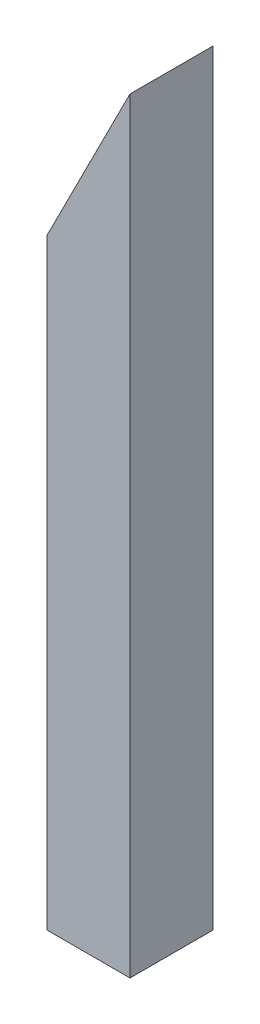
ISO-10303-21;
HEADER;
FILE_DESCRIPTION(('STEP AP214'),'2;1');
FILE_NAME('part.step','',(''),(''),'','','');
FILE_SCHEMA(('AUTOMOTIVE_DESIGN { 1 0 10303 214 1 1 1 1 }'));
ENDSEC;
DATA;
#1=APPLICATION_CONTEXT('core data for automotive mechanical design processes');
#2=APPLICATION_PROTOCOL_DEFINITION('international standard','automotive_design',2000,#1);
#3=PRODUCT_CONTEXT('',#1,'mechanical');
#4=PRODUCT('Part','Part','',(#3));
#5=PRODUCT_RELATED_PRODUCT_CATEGORY('part','',(#4));
#6=PRODUCT_DEFINITION_FORMATION('','',#4);
#7=PRODUCT_DEFINITION_CONTEXT('part definition',#1,'design');
#8=PRODUCT_DEFINITION('design','',#6,#7);
#9=PRODUCT_DEFINITION_SHAPE('','',#8);
#10=(LENGTH_UNIT() NAMED_UNIT(*) SI_UNIT(.MILLI.,.METRE.));
#11=(NAMED_UNIT(*) PLANE_ANGLE_UNIT() SI_UNIT($,.RADIAN.));
#12=(NAMED_UNIT(*) SI_UNIT($,.STERADIAN.) SOLID_ANGLE_UNIT());
#13=UNCERTAINTY_MEASURE_WITH_UNIT(LENGTH_MEASURE(1.E-05),#10,'distance_accuracy_value','');
#14=(GEOMETRIC_REPRESENTATION_CONTEXT(3) GLOBAL_UNCERTAINTY_ASSIGNED_CONTEXT((#13)) GLOBAL_UNIT_ASSIGNED_CONTEXT((#10,
#11,#12)) REPRESENTATION_CONTEXT('',''));
#15=CARTESIAN_POINT('',(0.,0.,0.));
#16=DIRECTION('',(0.,0.,1.));
#17=DIRECTION('',(1.,0.,0.));
#18=AXIS2_PLACEMENT_3D('',#15,#16,#17);
#19=CARTESIAN_POINT('',(0.,1472.10714489838,203.2));
#20=DIRECTION('',(1.,0.,0.));
#21=DIRECTION('',(0.,1.,0.));
#22=AXIS2_PLACEMENT_3D('',#19,#20,#21);
#23=PLANE('',#22);
#24=DIRECTION('',(0.,-1.,0.));
#25=VECTOR('',#24,1.);
#26=CARTESIAN_POINT('',(0.,1472.10714489838,0.));
#27=LINE('',#26,#25);
#28=CARTESIAN_POINT('',(0.,1472.10714489838,0.));
#29=VERTEX_POINT('',#28);
#30=CARTESIAN_POINT('',(0.,0.,0.));
#31=VERTEX_POINT('',#30);
#32=EDGE_CURVE('E121',#29,#31,#27,.T.);
#33=ORIENTED_EDGE('',*,*,#32,.T.);
#34=DIRECTION('',(0.,0.,-1.));
#35=VECTOR('',#34,1.);
#36=CARTESIAN_POINT('',(0.,0.,203.2));
#37=LINE('',#36,#35);
#38=CARTESIAN_POINT('',(0.,0.,203.2));
#39=VERTEX_POINT('',#38);
#40=EDGE_CURVE('E148',#39,#31,#37,.T.);
#41=ORIENTED_EDGE('',*,*,#40,.F.);
#42=DIRECTION('',(0.,-1.,0.));
#43=VECTOR('',#42,1.);
#44=CARTESIAN_POINT('',(0.,1472.10714489838,203.2));
#45=LINE('',#44,#43);
#46=CARTESIAN_POINT('',(0.,1472.10714489838,203.2));
#47=VERTEX_POINT('',#46);
#48=EDGE_CURVE('E122',#47,#39,#45,.T.);
#49=ORIENTED_EDGE('',*,*,#48,.F.);
#50=DIRECTION('',(0.,0.,-1.));
#51=VECTOR('',#50,1.);
#52=CARTESIAN_POINT('',(0.,1472.10714489838,203.2));
#53=LINE('',#52,#51);
#54=EDGE_CURVE('E132',#47,#29,#53,.T.);
#55=ORIENTED_EDGE('',*,*,#54,.T.);
#56=EDGE_LOOP('',(#33,#41,#49,#55));
#57=FACE_BOUND('',#56,.T.);
#58=ADVANCED_FACE('F33',(#57),#23,.F.);
#59=CARTESIAN_POINT('',(0.,0.,203.2));
#60=DIRECTION('',(0.,1.,0.));
#61=DIRECTION('',(0.,0.,1.));
#62=AXIS2_PLACEMENT_3D('',#59,#60,#61);
#63=PLANE('',#62);
#64=DIRECTION('',(1.,0.,0.));
#65=VECTOR('',#64,1.);
#66=CARTESIAN_POINT('',(0.,0.,184.15));
#67=LINE('',#66,#65);
#68=CARTESIAN_POINT('',(19.05,4.44089209850063E-13,184.15));
#69=VERTEX_POINT('',#68);
#70=CARTESIAN_POINT('',(184.15,0.,184.15));
#71=VERTEX_POINT('',#70);
#72=EDGE_CURVE('E94',#69,#71,#67,.T.);
#73=ORIENTED_EDGE('',*,*,#72,.T.);
#74=DIRECTION('',(0.,0.,-1.));
#75=VECTOR('',#74,1.);
#76=CARTESIAN_POINT('',(184.15,0.,203.2));
#77=LINE('',#76,#75);
#78=CARTESIAN_POINT('',(184.15,4.44089209850063E-13,19.05));
#79=VERTEX_POINT('',#78);
#80=EDGE_CURVE('E116',#71,#79,#77,.T.);
#81=ORIENTED_EDGE('',*,*,#80,.T.);
#82=DIRECTION('',(-1.,0.,0.));
#83=VECTOR('',#82,1.);
#84=CARTESIAN_POINT('',(0.,0.,19.05));
#85=LINE('',#84,#83);
#86=CARTESIAN_POINT('',(19.05,4.44089209850063E-13,19.05));
#87=VERTEX_POINT('',#86);
#88=EDGE_CURVE('E114',#79,#87,#85,.T.);
#89=ORIENTED_EDGE('',*,*,#88,.T.);
#90=DIRECTION('',(0.,0.,1.));
#91=VECTOR('',#90,1.);
#92=CARTESIAN_POINT('',(19.05,0.,203.2));
#93=LINE('',#92,#91);
#94=EDGE_CURVE('E99',#87,#69,#93,.T.);
#95=ORIENTED_EDGE('',*,*,#94,.T.);
#96=EDGE_LOOP('',(#73,#81,#89,#95));
#97=FACE_BOUND('',#96,.T.);
#98=DIRECTION('',(1.,0.,0.));
#99=VECTOR('',#98,1.);
#100=CARTESIAN_POINT('',(0.,0.,0.));
#101=LINE('',#100,#99);
#102=CARTESIAN_POINT('',(203.2,0.,0.));
#103=VERTEX_POINT('',#102);
#104=EDGE_CURVE('E135',#31,#103,#101,.T.);
#105=ORIENTED_EDGE('',*,*,#104,.T.);
#106=DIRECTION('',(0.,0.,-1.));
#107=VECTOR('',#106,1.);
#108=CARTESIAN_POINT('',(203.2,0.,203.2));
#109=LINE('',#108,#107);
#110=CARTESIAN_POINT('',(203.2,0.,203.2));
#111=VERTEX_POINT('',#110);
#112=EDGE_CURVE('E145',#111,#103,#109,.T.);
#113=ORIENTED_EDGE('',*,*,#112,.F.);
#114=DIRECTION('',(1.,0.,0.));
#115=VECTOR('',#114,1.);
#116=CARTESIAN_POINT('',(0.,0.,203.2));
#117=LINE('',#116,#115);
#118=EDGE_CURVE('E125',#39,#111,#117,.T.);
#119=ORIENTED_EDGE('',*,*,#118,.F.);
#120=ORIENTED_EDGE('',*,*,#40,.T.);
#121=EDGE_LOOP('',(#105,#113,#119,#120));
#122=FACE_BOUND('',#121,.T.);
#123=ADVANCED_FACE('F112',(#97,#122),#63,.F.);
#124=CARTESIAN_POINT('',(203.2,0.,203.2));
#125=DIRECTION('',(-1.,0.,0.));
#126=DIRECTION('',(0.,0.,1.));
#127=AXIS2_PLACEMENT_3D('',#124,#125,#126);
#128=PLANE('',#127);
#129=DIRECTION('',(0.,1.,0.));
#130=VECTOR('',#129,1.);
#131=CARTESIAN_POINT('',(203.2,0.,0.));
#132=LINE('',#131,#130);
#133=CARTESIAN_POINT('',(203.2,1873.504,0.));
#134=VERTEX_POINT('',#133);
#135=EDGE_CURVE('E137',#103,#134,#132,.T.);
#136=ORIENTED_EDGE('',*,*,#135,.T.);
#137=DIRECTION('',(0.,0.,-1.));
#138=VECTOR('',#137,1.);
#139=CARTESIAN_POINT('',(203.2,1873.504,203.2));
#140=LINE('',#139,#138);
#141=CARTESIAN_POINT('',(203.2,1873.504,203.2));
#142=VERTEX_POINT('',#141);
#143=EDGE_CURVE('E142',#142,#134,#140,.T.);
#144=ORIENTED_EDGE('',*,*,#143,.F.);
#145=DIRECTION('',(0.,1.,0.));
#146=VECTOR('',#145,1.);
#147=CARTESIAN_POINT('',(203.2,0.,203.2));
#148=LINE('',#147,#146);
#149=EDGE_CURVE('E128',#111,#142,#148,.T.);
#150=ORIENTED_EDGE('',*,*,#149,.F.);
#151=ORIENTED_EDGE('',*,*,#112,.T.);
#152=EDGE_LOOP('',(#136,#144,#150,#151));
#153=FACE_BOUND('',#152,.T.);
#154=ADVANCED_FACE('F183',(#153),#128,.F.);
#155=CARTESIAN_POINT('',(203.2,1873.504,203.2));
#156=DIRECTION('',(0.892192013750188,-0.45165629697856,0.));
#157=DIRECTION('',(0.45165629697856,0.892192013750188,0.));
#158=AXIS2_PLACEMENT_3D('',#155,#156,#157);
#159=PLANE('',#158);
#160=DIRECTION('',(0.45165629697856,0.892192013750188,0.));
#161=VECTOR('',#160,1.);
#162=CARTESIAN_POINT('',(203.2,1873.504,19.05));
#163=LINE('',#162,#161);
#164=CARTESIAN_POINT('',(19.05,1509.73810006416,19.05));
#165=VERTEX_POINT('',#164);
#166=CARTESIAN_POINT('',(184.15,1835.87304483422,19.05));
#167=VERTEX_POINT('',#166);
#168=EDGE_CURVE('E40',#165,#167,#163,.T.);
#169=ORIENTED_EDGE('',*,*,#168,.T.);
#170=DIRECTION('',(0.,0.,1.));
#171=VECTOR('',#170,1.);
#172=CARTESIAN_POINT('',(184.15,1835.87304483422,203.2));
#173=LINE('',#172,#171);
#174=CARTESIAN_POINT('',(184.15,1835.87304483422,184.15));
#175=VERTEX_POINT('',#174);
#176=EDGE_CURVE('E11',#167,#175,#173,.T.);
#177=ORIENTED_EDGE('',*,*,#176,.T.);
#178=DIRECTION('',(-0.45165629697856,-0.892192013750188,0.));
#179=VECTOR('',#178,1.);
#180=CARTESIAN_POINT('',(203.2,1873.504,184.15));
#181=LINE('',#180,#179);
#182=CARTESIAN_POINT('',(19.05,1509.73810006416,184.15));
#183=VERTEX_POINT('',#182);
#184=EDGE_CURVE('E151',#175,#183,#181,.T.);
#185=ORIENTED_EDGE('',*,*,#184,.T.);
#186=DIRECTION('',(0.,0.,-1.));
#187=VECTOR('',#186,1.);
#188=CARTESIAN_POINT('',(19.05,1509.73810006416,203.2));
#189=LINE('',#188,#187);
#190=EDGE_CURVE('E107',#183,#165,#189,.T.);
#191=ORIENTED_EDGE('',*,*,#190,.T.);
#192=EDGE_LOOP('',(#169,#177,#185,#191));
#193=FACE_BOUND('',#192,.T.);
#194=DIRECTION('',(-0.45165629697856,-0.892192013750188,0.));
#195=VECTOR('',#194,1.);
#196=CARTESIAN_POINT('',(203.2,1873.504,0.));
#197=LINE('',#196,#195);
#198=EDGE_CURVE('E126',#134,#29,#197,.T.);
#199=ORIENTED_EDGE('',*,*,#198,.T.);
#200=ORIENTED_EDGE('',*,*,#54,.F.);
#201=DIRECTION('',(-0.45165629697856,-0.892192013750188,0.));
#202=VECTOR('',#201,1.);
#203=CARTESIAN_POINT('',(203.2,1873.504,203.2));
#204=LINE('',#203,#202);
#205=EDGE_CURVE('E130',#142,#47,#204,.T.);
#206=ORIENTED_EDGE('',*,*,#205,.F.);
#207=ORIENTED_EDGE('',*,*,#143,.T.);
#208=EDGE_LOOP('',(#199,#200,#206,#207));
#209=FACE_BOUND('',#208,.T.);
#210=ADVANCED_FACE('F155',(#193,#209),#159,.F.);
#211=CARTESIAN_POINT('',(0.,0.,203.2));
#212=DIRECTION('',(0.,0.,1.));
#213=DIRECTION('',(1.,0.,0.));
#214=AXIS2_PLACEMENT_3D('',#211,#212,#213);
#215=PLANE('',#214);
#216=ORIENTED_EDGE('',*,*,#48,.T.);
#217=ORIENTED_EDGE('',*,*,#118,.T.);
#218=ORIENTED_EDGE('',*,*,#149,.T.);
#219=ORIENTED_EDGE('',*,*,#205,.T.);
#220=EDGE_LOOP('',(#216,#217,#218,#219));
#221=FACE_BOUND('',#220,.T.);
#222=ADVANCED_FACE('F173',(#221),#215,.T.);
#223=CARTESIAN_POINT('',(0.,0.,0.));
#224=DIRECTION('',(0.,0.,1.));
#225=DIRECTION('',(1.,0.,0.));
#226=AXIS2_PLACEMENT_3D('',#223,#224,#225);
#227=PLANE('',#226);
#228=ORIENTED_EDGE('',*,*,#32,.F.);
#229=ORIENTED_EDGE('',*,*,#198,.F.);
#230=ORIENTED_EDGE('',*,*,#135,.F.);
#231=ORIENTED_EDGE('',*,*,#104,.F.);
#232=EDGE_LOOP('',(#228,#229,#230,#231));
#233=FACE_BOUND('',#232,.T.);
#234=ADVANCED_FACE('F166',(#233),#227,.F.);
#235=CARTESIAN_POINT('',(184.15,1873.504,19.05));
#236=DIRECTION('',(1.,0.,0.));
#237=DIRECTION('',(0.,0.,-1.));
#238=AXIS2_PLACEMENT_3D('',#235,#236,#237);
#239=PLANE('',#238);
#240=DIRECTION('',(0.,-1.,0.));
#241=VECTOR('',#240,1.);
#242=CARTESIAN_POINT('',(184.15,1873.504,184.15));
#243=LINE('',#242,#241);
#244=EDGE_CURVE('E47',#175,#71,#243,.T.);
#245=ORIENTED_EDGE('',*,*,#244,.F.);
#246=ORIENTED_EDGE('',*,*,#176,.F.);
#247=DIRECTION('',(0.,-1.,0.));
#248=VECTOR('',#247,1.);
#249=CARTESIAN_POINT('',(184.15,1873.504,19.05));
#250=LINE('',#249,#248);
#251=EDGE_CURVE('E100',#167,#79,#250,.T.);
#252=ORIENTED_EDGE('',*,*,#251,.T.);
#253=ORIENTED_EDGE('',*,*,#80,.F.);
#254=EDGE_LOOP('',(#245,#246,#252,#253));
#255=FACE_BOUND('',#254,.T.);
#256=ADVANCED_FACE('F164',(#255),#239,.F.);
#257=CARTESIAN_POINT('',(19.05,1873.504,19.05));
#258=DIRECTION('',(0.,0.,-1.));
#259=DIRECTION('',(-1.,0.,0.));
#260=AXIS2_PLACEMENT_3D('',#257,#258,#259);
#261=PLANE('',#260);
#262=ORIENTED_EDGE('',*,*,#251,.F.);
#263=ORIENTED_EDGE('',*,*,#168,.F.);
#264=DIRECTION('',(0.,-1.,0.));
#265=VECTOR('',#264,1.);
#266=CARTESIAN_POINT('',(19.05,1873.504,19.05));
#267=LINE('',#266,#265);
#268=EDGE_CURVE('E109',#165,#87,#267,.T.);
#269=ORIENTED_EDGE('',*,*,#268,.T.);
#270=ORIENTED_EDGE('',*,*,#88,.F.);
#271=EDGE_LOOP('',(#262,#263,#269,#270));
#272=FACE_BOUND('',#271,.T.);
#273=ADVANCED_FACE('F159',(#272),#261,.F.);
#274=CARTESIAN_POINT('',(19.05,1873.504,184.15));
#275=DIRECTION('',(-1.,0.,0.));
#276=DIRECTION('',(0.,0.,1.));
#277=AXIS2_PLACEMENT_3D('',#274,#275,#276);
#278=PLANE('',#277);
#279=ORIENTED_EDGE('',*,*,#268,.F.);
#280=ORIENTED_EDGE('',*,*,#190,.F.);
#281=DIRECTION('',(0.,-1.,0.));
#282=VECTOR('',#281,1.);
#283=CARTESIAN_POINT('',(19.05,1873.504,184.15));
#284=LINE('',#283,#282);
#285=EDGE_CURVE('E52',#183,#69,#284,.T.);
#286=ORIENTED_EDGE('',*,*,#285,.T.);
#287=ORIENTED_EDGE('',*,*,#94,.F.);
#288=EDGE_LOOP('',(#279,#280,#286,#287));
#289=FACE_BOUND('',#288,.T.);
#290=ADVANCED_FACE('F104',(#289),#278,.F.);
#291=CARTESIAN_POINT('',(184.15,1873.504,184.15));
#292=DIRECTION('',(0.,0.,1.));
#293=DIRECTION('',(1.,0.,0.));
#294=AXIS2_PLACEMENT_3D('',#291,#292,#293);
#295=PLANE('',#294);
#296=ORIENTED_EDGE('',*,*,#285,.F.);
#297=ORIENTED_EDGE('',*,*,#184,.F.);
#298=ORIENTED_EDGE('',*,*,#244,.T.);
#299=ORIENTED_EDGE('',*,*,#72,.F.);
#300=EDGE_LOOP('',(#296,#297,#298,#299));
#301=FACE_BOUND('',#300,.T.);
#302=ADVANCED_FACE('F95',(#301),#295,.F.);
#303=CLOSED_SHELL('',(#58,#123,#154,#210,#222,#234,#256,#273,#290,#302));
#304=MANIFOLD_SOLID_BREP('B2',#303);
#305=ADVANCED_BREP_SHAPE_REPRESENTATION('',(#18,#304),#14);
#306=SHAPE_DEFINITION_REPRESENTATION(#9,#305);
ENDSEC;
END-ISO-10303-21;
